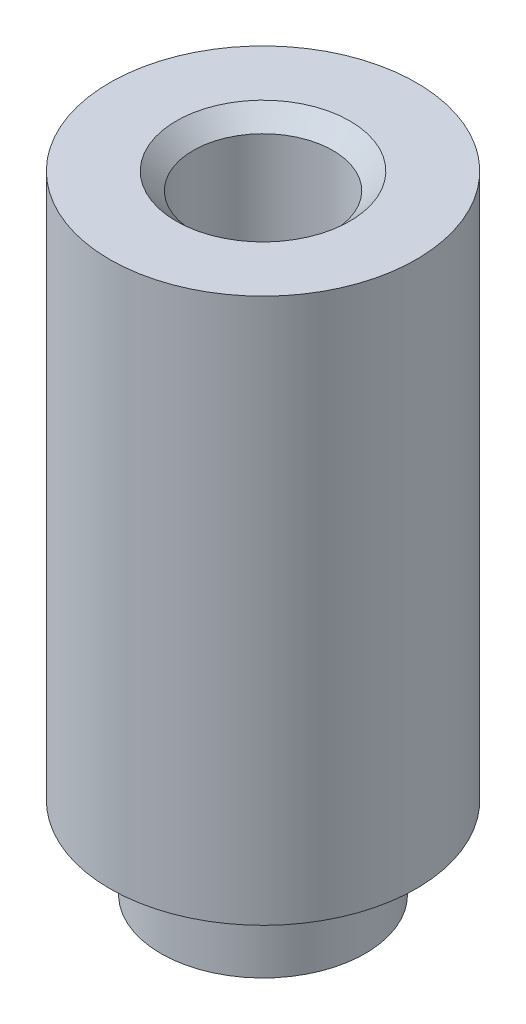
ISO-10303-21;
HEADER;
FILE_DESCRIPTION(('STEP AP214'),'2;1');
FILE_NAME('part.step','',(''),(''),'','','');
FILE_SCHEMA(('AUTOMOTIVE_DESIGN { 1 0 10303 214 1 1 1 1 }'));
ENDSEC;
DATA;
#1=APPLICATION_CONTEXT('core data for automotive mechanical design processes');
#2=APPLICATION_PROTOCOL_DEFINITION('international standard','automotive_design',2000,#1);
#3=PRODUCT_CONTEXT('',#1,'mechanical');
#4=PRODUCT('Part','Part','',(#3));
#5=PRODUCT_RELATED_PRODUCT_CATEGORY('part','',(#4));
#6=PRODUCT_DEFINITION_FORMATION('','',#4);
#7=PRODUCT_DEFINITION_CONTEXT('part definition',#1,'design');
#8=PRODUCT_DEFINITION('design','',#6,#7);
#9=PRODUCT_DEFINITION_SHAPE('','',#8);
#10=(LENGTH_UNIT() NAMED_UNIT(*) SI_UNIT(.MILLI.,.METRE.));
#11=(NAMED_UNIT(*) PLANE_ANGLE_UNIT() SI_UNIT($,.RADIAN.));
#12=(NAMED_UNIT(*) SI_UNIT($,.STERADIAN.) SOLID_ANGLE_UNIT());
#13=UNCERTAINTY_MEASURE_WITH_UNIT(LENGTH_MEASURE(1.E-05),#10,'distance_accuracy_value','');
#14=(GEOMETRIC_REPRESENTATION_CONTEXT(3) GLOBAL_UNCERTAINTY_ASSIGNED_CONTEXT((#13)) GLOBAL_UNIT_ASSIGNED_CONTEXT((#10,
#11,#12)) REPRESENTATION_CONTEXT('',''));
#15=CARTESIAN_POINT('',(0.,0.,0.));
#16=DIRECTION('',(0.,0.,1.));
#17=DIRECTION('',(1.,0.,0.));
#18=AXIS2_PLACEMENT_3D('',#15,#16,#17);
#19=CARTESIAN_POINT('',(0.,1.2,0.));
#20=DIRECTION('',(0.,-1.,0.));
#21=DIRECTION('',(0.,0.,-1.));
#22=AXIS2_PLACEMENT_3D('',#19,#20,#21);
#23=CYLINDRICAL_SURFACE('',#22,1.5);
#24=CARTESIAN_POINT('',(0.,1.2,0.));
#25=DIRECTION('',(0.,1.,0.));
#26=DIRECTION('',(0.,0.,1.));
#27=AXIS2_PLACEMENT_3D('',#24,#25,#26);
#28=CIRCLE('',#27,1.5);
#29=CARTESIAN_POINT('',(0.,1.2,1.5));
#30=VERTEX_POINT('',#29);
#31=EDGE_CURVE('E10',#30,#30,#28,.T.);
#32=ORIENTED_EDGE('',*,*,#31,.F.);
#33=EDGE_LOOP('',(#32));
#34=FACE_BOUND('',#33,.T.);
#35=CARTESIAN_POINT('',(0.,0.,0.));
#36=DIRECTION('',(0.,1.,0.));
#37=DIRECTION('',(0.,0.,1.));
#38=AXIS2_PLACEMENT_3D('',#35,#36,#37);
#39=CIRCLE('',#38,1.5);
#40=CARTESIAN_POINT('',(0.,0.,1.5));
#41=VERTEX_POINT('',#40);
#42=EDGE_CURVE('E42',#41,#41,#39,.T.);
#43=ORIENTED_EDGE('',*,*,#42,.T.);
#44=EDGE_LOOP('',(#43));
#45=FACE_BOUND('',#44,.T.);
#46=ADVANCED_FACE('F39',(#34,#45),#23,.T.);
#47=CARTESIAN_POINT('',(0.,0.,0.));
#48=DIRECTION('',(0.,1.,0.));
#49=DIRECTION('',(0.,0.,1.));
#50=AXIS2_PLACEMENT_3D('',#47,#48,#49);
#51=PLANE('',#50);
#52=CARTESIAN_POINT('',(0.,0.,0.));
#53=DIRECTION('',(0.,1.,0.));
#54=DIRECTION('',(0.,0.,1.));
#55=AXIS2_PLACEMENT_3D('',#52,#53,#54);
#56=CIRCLE('',#55,1.025);
#57=CARTESIAN_POINT('',(0.,0.,1.025));
#58=VERTEX_POINT('',#57);
#59=EDGE_CURVE('E54',#58,#58,#56,.T.);
#60=ORIENTED_EDGE('',*,*,#59,.T.);
#61=EDGE_LOOP('',(#60));
#62=FACE_BOUND('',#61,.T.);
#63=ORIENTED_EDGE('',*,*,#42,.F.);
#64=EDGE_LOOP('',(#63));
#65=FACE_BOUND('',#64,.T.);
#66=ADVANCED_FACE('F78',(#62,#65),#51,.F.);
#67=CARTESIAN_POINT('',(0.,9.2,0.));
#68=DIRECTION('',(0.,-1.,0.));
#69=DIRECTION('',(0.,0.,-1.));
#70=AXIS2_PLACEMENT_3D('',#67,#68,#69);
#71=CYLINDRICAL_SURFACE('',#70,2.25);
#72=CARTESIAN_POINT('',(0.,9.2,0.));
#73=DIRECTION('',(0.,1.,0.));
#74=DIRECTION('',(0.,0.,1.));
#75=AXIS2_PLACEMENT_3D('',#72,#73,#74);
#76=CIRCLE('',#75,2.25);
#77=CARTESIAN_POINT('',(0.,9.2,2.25));
#78=VERTEX_POINT('',#77);
#79=EDGE_CURVE('E49',#78,#78,#76,.T.);
#80=ORIENTED_EDGE('',*,*,#79,.F.);
#81=EDGE_LOOP('',(#80));
#82=FACE_BOUND('',#81,.T.);
#83=CARTESIAN_POINT('',(0.,1.2,0.));
#84=DIRECTION('',(0.,1.,0.));
#85=DIRECTION('',(0.,0.,1.));
#86=AXIS2_PLACEMENT_3D('',#83,#84,#85);
#87=CIRCLE('',#86,2.25);
#88=CARTESIAN_POINT('',(0.,1.2,2.25));
#89=VERTEX_POINT('',#88);
#90=EDGE_CURVE('E51',#89,#89,#87,.T.);
#91=ORIENTED_EDGE('',*,*,#90,.T.);
#92=EDGE_LOOP('',(#91));
#93=FACE_BOUND('',#92,.T.);
#94=ADVANCED_FACE('F72',(#82,#93),#71,.T.);
#95=CARTESIAN_POINT('',(0.,9.2,0.));
#96=DIRECTION('',(0.,1.,0.));
#97=DIRECTION('',(0.,0.,1.));
#98=AXIS2_PLACEMENT_3D('',#95,#96,#97);
#99=PLANE('',#98);
#100=CARTESIAN_POINT('',(0.,9.2,0.));
#101=DIRECTION('',(0.,1.,0.));
#102=DIRECTION('',(0.,0.,1.));
#103=AXIS2_PLACEMENT_3D('',#100,#101,#102);
#104=CIRCLE('',#103,1.275);
#105=CARTESIAN_POINT('',(0.,9.2,1.275));
#106=VERTEX_POINT('',#105);
#107=EDGE_CURVE('E62',#106,#106,#104,.T.);
#108=ORIENTED_EDGE('',*,*,#107,.F.);
#109=EDGE_LOOP('',(#108));
#110=FACE_BOUND('',#109,.T.);
#111=ORIENTED_EDGE('',*,*,#79,.T.);
#112=EDGE_LOOP('',(#111));
#113=FACE_BOUND('',#112,.T.);
#114=ADVANCED_FACE('F68',(#110,#113),#99,.T.);
#115=CARTESIAN_POINT('',(0.,1.2,0.));
#116=DIRECTION('',(0.,1.,0.));
#117=DIRECTION('',(0.,0.,1.));
#118=AXIS2_PLACEMENT_3D('',#115,#116,#117);
#119=PLANE('',#118);
#120=ORIENTED_EDGE('',*,*,#31,.T.);
#121=EDGE_LOOP('',(#120));
#122=FACE_BOUND('',#121,.T.);
#123=ORIENTED_EDGE('',*,*,#90,.F.);
#124=EDGE_LOOP('',(#123));
#125=FACE_BOUND('',#124,.T.);
#126=ADVANCED_FACE('F71',(#122,#125),#119,.F.);
#127=CARTESIAN_POINT('',(0.,9.2,0.));
#128=DIRECTION('',(0.,1.,0.));
#129=DIRECTION('',(0.,0.,1.));
#130=AXIS2_PLACEMENT_3D('',#127,#128,#129);
#131=CYLINDRICAL_SURFACE('',#130,1.025);
#132=ORIENTED_EDGE('',*,*,#59,.F.);
#133=EDGE_LOOP('',(#132));
#134=FACE_BOUND('',#133,.T.);
#135=CARTESIAN_POINT('',(0.,8.95,0.));
#136=DIRECTION('',(0.,1.,0.));
#137=DIRECTION('',(0.,0.,1.));
#138=AXIS2_PLACEMENT_3D('',#135,#136,#137);
#139=CIRCLE('',#138,1.025);
#140=CARTESIAN_POINT('',(0.,8.95,1.025));
#141=VERTEX_POINT('',#140);
#142=EDGE_CURVE('E59',#141,#141,#139,.T.);
#143=ORIENTED_EDGE('',*,*,#142,.T.);
#144=EDGE_LOOP('',(#143));
#145=FACE_BOUND('',#144,.T.);
#146=ADVANCED_FACE('F83',(#134,#145),#131,.F.);
#147=CARTESIAN_POINT('',(0.,9.2,0.));
#148=DIRECTION('',(0.,1.,0.));
#149=DIRECTION('',(0.,0.,1.));
#150=AXIS2_PLACEMENT_3D('',#147,#148,#149);
#151=CONICAL_SURFACE('',#150,1.275,0.785398163397447);
#152=ORIENTED_EDGE('',*,*,#142,.F.);
#153=EDGE_LOOP('',(#152));
#154=FACE_BOUND('',#153,.T.);
#155=ORIENTED_EDGE('',*,*,#107,.T.);
#156=EDGE_LOOP('',(#155));
#157=FACE_BOUND('',#156,.T.);
#158=ADVANCED_FACE('F66',(#154,#157),#151,.F.);
#159=CLOSED_SHELL('',(#46,#66,#94,#114,#126,#146,#158));
#160=MANIFOLD_SOLID_BREP('B2',#159);
#161=ADVANCED_BREP_SHAPE_REPRESENTATION('',(#18,#160),#14);
#162=SHAPE_DEFINITION_REPRESENTATION(#9,#161);
ENDSEC;
END-ISO-10303-21;
